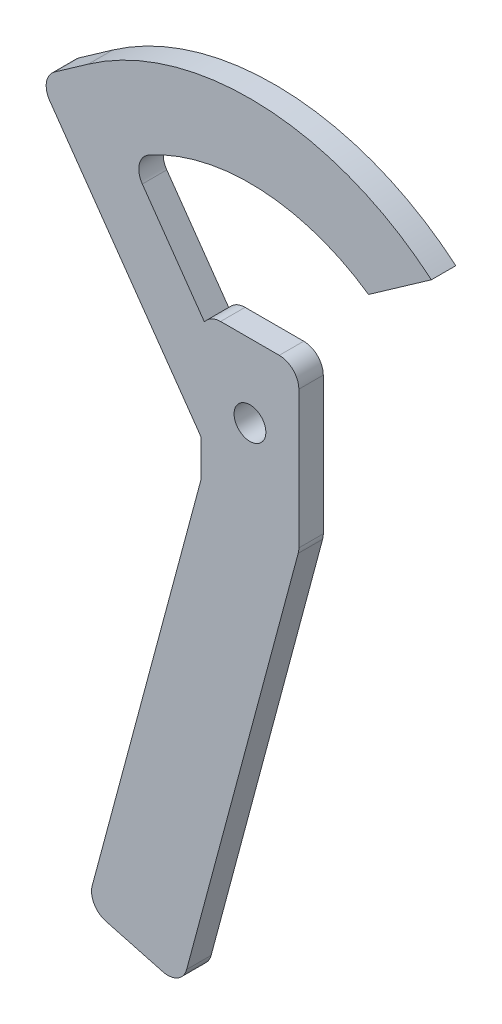
ISO-10303-21;
HEADER;
FILE_DESCRIPTION(('STEP AP214'),'2;1');
FILE_NAME('part.step','',(''),(''),'','','');
FILE_SCHEMA(('AUTOMOTIVE_DESIGN { 1 0 10303 214 1 1 1 1 }'));
ENDSEC;
DATA;
#1=APPLICATION_CONTEXT('core data for automotive mechanical design processes');
#2=APPLICATION_PROTOCOL_DEFINITION('international standard','automotive_design',2000,#1);
#3=PRODUCT_CONTEXT('',#1,'mechanical');
#4=PRODUCT('Part','Part','',(#3));
#5=PRODUCT_RELATED_PRODUCT_CATEGORY('part','',(#4));
#6=PRODUCT_DEFINITION_FORMATION('','',#4);
#7=PRODUCT_DEFINITION_CONTEXT('part definition',#1,'design');
#8=PRODUCT_DEFINITION('design','',#6,#7);
#9=PRODUCT_DEFINITION_SHAPE('','',#8);
#10=(LENGTH_UNIT() NAMED_UNIT(*) SI_UNIT(.MILLI.,.METRE.));
#11=(NAMED_UNIT(*) PLANE_ANGLE_UNIT() SI_UNIT($,.RADIAN.));
#12=(NAMED_UNIT(*) SI_UNIT($,.STERADIAN.) SOLID_ANGLE_UNIT());
#13=UNCERTAINTY_MEASURE_WITH_UNIT(LENGTH_MEASURE(1.E-05),#10,'distance_accuracy_value','');
#14=(GEOMETRIC_REPRESENTATION_CONTEXT(3) GLOBAL_UNCERTAINTY_ASSIGNED_CONTEXT((#13)) GLOBAL_UNIT_ASSIGNED_CONTEXT((#10,
#11,#12)) REPRESENTATION_CONTEXT('',''));
#15=CARTESIAN_POINT('',(0.,0.,0.));
#16=DIRECTION('',(0.,0.,1.));
#17=DIRECTION('',(1.,0.,0.));
#18=AXIS2_PLACEMENT_3D('',#15,#16,#17);
#19=CARTESIAN_POINT('',(0.,221.32548310435,5.));
#20=DIRECTION('',(0.,-1.,0.));
#21=DIRECTION('',(0.,0.,-1.));
#22=AXIS2_PLACEMENT_3D('',#19,#20,#21);
#23=PLANE('',#22);
#24=DIRECTION('',(-1.,0.,0.));
#25=VECTOR('',#24,1.);
#26=CARTESIAN_POINT('',(0.,221.32548310435,0.));
#27=LINE('',#26,#25);
#28=CARTESIAN_POINT('',(299.53045515725,221.32548310435,0.));
#29=VERTEX_POINT('',#28);
#30=CARTESIAN_POINT('',(287.53045515725,221.32548310435,0.));
#31=VERTEX_POINT('',#30);
#32=EDGE_CURVE('E219',#29,#31,#27,.T.);
#33=ORIENTED_EDGE('',*,*,#32,.T.);
#34=DIRECTION('',(0.,0.,-1.));
#35=VECTOR('',#34,1.);
#36=CARTESIAN_POINT('',(287.53045515725,221.32548310435,5.));
#37=LINE('',#36,#35);
#38=CARTESIAN_POINT('',(287.53045515725,221.32548310435,5.));
#39=VERTEX_POINT('',#38);
#40=EDGE_CURVE('E11',#39,#31,#37,.T.);
#41=ORIENTED_EDGE('',*,*,#40,.F.);
#42=DIRECTION('',(-1.,0.,0.));
#43=VECTOR('',#42,1.);
#44=CARTESIAN_POINT('',(0.,221.32548310435,5.));
#45=LINE('',#44,#43);
#46=CARTESIAN_POINT('',(299.53045515725,221.32548310435,5.));
#47=VERTEX_POINT('',#46);
#48=EDGE_CURVE('E377',#47,#39,#45,.T.);
#49=ORIENTED_EDGE('',*,*,#48,.F.);
#50=DIRECTION('',(0.,0.,-1.));
#51=VECTOR('',#50,1.);
#52=CARTESIAN_POINT('',(299.53045515725,221.32548310435,5.));
#53=LINE('',#52,#51);
#54=EDGE_CURVE('E212',#47,#29,#53,.T.);
#55=ORIENTED_EDGE('',*,*,#54,.T.);
#56=EDGE_LOOP('',(#33,#41,#49,#55));
#57=FACE_BOUND('',#56,.T.);
#58=ADVANCED_FACE('F35',(#57),#23,.F.);
#59=CARTESIAN_POINT('',(287.53045515725,217.32548310435,5.));
#60=DIRECTION('',(0.,0.,-1.));
#61=DIRECTION('',(-1.,0.,0.));
#62=AXIS2_PLACEMENT_3D('',#59,#60,#61);
#63=CYLINDRICAL_SURFACE('',#62,4.);
#64=CARTESIAN_POINT('',(287.53045515725,217.32548310435,0.));
#65=DIRECTION('',(0.,0.,1.));
#66=DIRECTION('',(1.,0.,0.));
#67=AXIS2_PLACEMENT_3D('',#64,#65,#66);
#68=CIRCLE('',#67,4.);
#69=CARTESIAN_POINT('',(284.223556624,219.5759101951,0.));
#70=VERTEX_POINT('',#69);
#71=EDGE_CURVE('E222',#31,#70,#68,.T.);
#72=ORIENTED_EDGE('',*,*,#71,.T.);
#73=DIRECTION('',(0.,0.,-1.));
#74=VECTOR('',#73,1.);
#75=CARTESIAN_POINT('',(284.223556624,219.5759101951,5.));
#76=LINE('',#75,#74);
#77=CARTESIAN_POINT('',(284.223556624,219.5759101951,5.));
#78=VERTEX_POINT('',#77);
#79=EDGE_CURVE('E44',#78,#70,#76,.T.);
#80=ORIENTED_EDGE('',*,*,#79,.F.);
#81=CARTESIAN_POINT('',(287.53045515725,217.32548310435,5.));
#82=DIRECTION('',(0.,0.,1.));
#83=DIRECTION('',(1.,0.,0.));
#84=AXIS2_PLACEMENT_3D('',#81,#82,#83);
#85=CIRCLE('',#84,4.);
#86=EDGE_CURVE('E137',#39,#78,#85,.T.);
#87=ORIENTED_EDGE('',*,*,#86,.F.);
#88=ORIENTED_EDGE('',*,*,#40,.T.);
#89=EDGE_LOOP('',(#72,#80,#87,#88));
#90=FACE_BOUND('',#89,.T.);
#91=ADVANCED_FACE('F391',(#90),#63,.T.);
#92=CARTESIAN_POINT('',(293.602960554349,206.222255646245,5.));
#93=DIRECTION('',(-0.818314055671164,-0.57477135131373,0.));
#94=DIRECTION('',(0.57477135131373,-0.818314055671164,0.));
#95=AXIS2_PLACEMENT_3D('',#92,#93,#94);
#96=PLANE('',#95);
#97=DIRECTION('',(-0.57477135131373,0.818314055671164,0.));
#98=VECTOR('',#97,1.);
#99=CARTESIAN_POINT('',(293.602960554349,206.222255646245,0.));
#100=LINE('',#99,#98);
#101=CARTESIAN_POINT('',(271.521515193,237.6600736019,0.));
#102=VERTEX_POINT('',#101);
#103=EDGE_CURVE('E224',#70,#102,#100,.T.);
#104=ORIENTED_EDGE('',*,*,#103,.T.);
#105=DIRECTION('',(0.,0.,-1.));
#106=VECTOR('',#105,1.);
#107=CARTESIAN_POINT('',(271.521515193,237.6600736019,5.));
#108=LINE('',#107,#106);
#109=CARTESIAN_POINT('',(271.521515193,237.6600736019,5.));
#110=VERTEX_POINT('',#109);
#111=EDGE_CURVE('E311',#110,#102,#108,.T.);
#112=ORIENTED_EDGE('',*,*,#111,.F.);
#113=DIRECTION('',(-0.57477135131373,0.818314055671164,0.));
#114=VECTOR('',#113,1.);
#115=CARTESIAN_POINT('',(293.602960554349,206.222255646245,5.));
#116=LINE('',#115,#114);
#117=EDGE_CURVE('E318',#78,#110,#116,.T.);
#118=ORIENTED_EDGE('',*,*,#117,.F.);
#119=ORIENTED_EDGE('',*,*,#79,.T.);
#120=EDGE_LOOP('',(#104,#112,#118,#119));
#121=FACE_BOUND('',#120,.T.);
#122=ADVANCED_FACE('F316',(#121),#96,.F.);
#123=CARTESIAN_POINT('',(274.794771415692,239.959159007145,5.));
#124=DIRECTION('',(0.,0.,-1.));
#125=DIRECTION('',(-1.,0.,0.));
#126=AXIS2_PLACEMENT_3D('',#123,#124,#125);
#127=CYLINDRICAL_SURFACE('',#126,4.00000000000004);
#128=CARTESIAN_POINT('',(274.794771415692,239.959159007145,0.));
#129=DIRECTION('',(0.,0.,1.));
#130=DIRECTION('',(1.,0.,0.));
#131=AXIS2_PLACEMENT_3D('',#128,#129,#130);
#132=CIRCLE('',#131,4.00000000000004);
#133=CARTESIAN_POINT('',(272.848206871121,243.453566893157,0.));
#134=VERTEX_POINT('',#133);
#135=EDGE_CURVE('E227',#134,#102,#132,.T.);
#136=ORIENTED_EDGE('',*,*,#135,.F.);
#137=DIRECTION('',(0.,0.,-1.));
#138=VECTOR('',#137,1.);
#139=CARTESIAN_POINT('',(272.848206871121,243.453566893157,5.));
#140=LINE('',#139,#138);
#141=CARTESIAN_POINT('',(272.848206871121,243.453566893157,5.));
#142=VERTEX_POINT('',#141);
#143=EDGE_CURVE('E309',#142,#134,#140,.T.);
#144=ORIENTED_EDGE('',*,*,#143,.F.);
#145=CARTESIAN_POINT('',(274.794771415692,239.959159007145,5.));
#146=DIRECTION('',(0.,0.,1.));
#147=DIRECTION('',(1.,0.,0.));
#148=AXIS2_PLACEMENT_3D('',#145,#146,#147);
#149=CIRCLE('',#148,4.00000000000004);
#150=EDGE_CURVE('E329',#142,#110,#149,.T.);
#151=ORIENTED_EDGE('',*,*,#150,.T.);
#152=ORIENTED_EDGE('',*,*,#111,.T.);
#153=EDGE_LOOP('',(#136,#144,#151,#152));
#154=FACE_BOUND('',#153,.T.);
#155=ADVANCED_FACE('F326',(#154),#127,.F.);
#156=CARTESIAN_POINT('',(293.530455157242,206.325483104316,5.));
#157=DIRECTION('',(0.,0.,-1.));
#158=DIRECTION('',(-1.,0.,0.));
#159=AXIS2_PLACEMENT_3D('',#156,#157,#158);
#160=CYLINDRICAL_SURFACE('',#159,42.5);
#161=CARTESIAN_POINT('',(293.530455157242,206.325483104316,0.));
#162=DIRECTION('',(0.,0.,1.));
#163=DIRECTION('',(1.,0.,0.));
#164=AXIS2_PLACEMENT_3D('',#161,#162,#163);
#165=CIRCLE('',#164,42.5);
#166=CARTESIAN_POINT('',(317.78434787185,241.2253210436,0.));
#167=VERTEX_POINT('',#166);
#168=EDGE_CURVE('E230',#167,#134,#165,.T.);
#169=ORIENTED_EDGE('',*,*,#168,.F.);
#170=DIRECTION('',(0.,0.,-1.));
#171=VECTOR('',#170,1.);
#172=CARTESIAN_POINT('',(317.78434787185,241.2253210436,5.));
#173=LINE('',#172,#171);
#174=CARTESIAN_POINT('',(317.78434787185,241.2253210436,5.));
#175=VERTEX_POINT('',#174);
#176=EDGE_CURVE('E307',#175,#167,#173,.T.);
#177=ORIENTED_EDGE('',*,*,#176,.F.);
#178=CARTESIAN_POINT('',(293.530455157242,206.325483104316,5.));
#179=DIRECTION('',(0.,0.,1.));
#180=DIRECTION('',(1.,0.,0.));
#181=AXIS2_PLACEMENT_3D('',#178,#179,#180);
#182=CIRCLE('',#181,42.5);
#183=EDGE_CURVE('E332',#175,#142,#182,.T.);
#184=ORIENTED_EDGE('',*,*,#183,.T.);
#185=ORIENTED_EDGE('',*,*,#143,.T.);
#186=EDGE_LOOP('',(#169,#177,#184,#185));
#187=FACE_BOUND('',#186,.T.);
#188=ADVANCED_FACE('F401',(#187),#160,.F.);
#189=CARTESIAN_POINT('',(-8.47484938695295,12.0658212298591,5.));
#190=DIRECTION('',(-0.574771351316157,0.818314055669459,0.));
#191=DIRECTION('',(-0.818314055669459,-0.574771351316157,0.));
#192=AXIS2_PLACEMENT_3D('',#189,#190,#191);
#193=PLANE('',#192);
#194=DIRECTION('',(0.818314055669459,0.574771351316157,0.));
#195=VECTOR('',#194,1.);
#196=CARTESIAN_POINT('',(-8.47484938695295,12.0658212298591,0.));
#197=LINE('',#196,#195);
#198=CARTESIAN_POINT('',(330.6351066323,250.2514986181,0.));
#199=VERTEX_POINT('',#198);
#200=EDGE_CURVE('E233',#167,#199,#197,.T.);
#201=ORIENTED_EDGE('',*,*,#200,.T.);
#202=DIRECTION('',(0.,0.,-1.));
#203=VECTOR('',#202,1.);
#204=CARTESIAN_POINT('',(330.6351066323,250.2514986181,5.));
#205=LINE('',#204,#203);
#206=CARTESIAN_POINT('',(330.6351066323,250.2514986181,5.));
#207=VERTEX_POINT('',#206);
#208=EDGE_CURVE('E304',#207,#199,#205,.T.);
#209=ORIENTED_EDGE('',*,*,#208,.F.);
#210=DIRECTION('',(0.818314055669459,0.574771351316157,0.));
#211=VECTOR('',#210,1.);
#212=CARTESIAN_POINT('',(-8.47484938695295,12.0658212298591,5.));
#213=LINE('',#212,#211);
#214=EDGE_CURVE('E334',#175,#207,#213,.T.);
#215=ORIENTED_EDGE('',*,*,#214,.F.);
#216=ORIENTED_EDGE('',*,*,#176,.T.);
#217=EDGE_LOOP('',(#201,#209,#215,#216));
#218=FACE_BOUND('',#217,.T.);
#219=ADVANCED_FACE('F404',(#218),#193,.F.);
#220=CARTESIAN_POINT('',(293.530455157242,206.325483104316,5.));
#221=DIRECTION('',(0.,0.,-1.));
#222=DIRECTION('',(-1.,0.,0.));
#223=AXIS2_PLACEMENT_3D('',#220,#221,#222);
#224=CYLINDRICAL_SURFACE('',#223,57.5000000000235);
#225=CARTESIAN_POINT('',(293.530455157242,206.325483104316,0.));
#226=DIRECTION('',(0.,0.,1.));
#227=DIRECTION('',(1.,0.,0.));
#228=AXIS2_PLACEMENT_3D('',#225,#226,#227);
#229=CIRCLE('',#228,57.5000000000235);
#230=CARTESIAN_POINT('',(260.481102456684,253.378541305423,0.));
#231=VERTEX_POINT('',#230);
#232=EDGE_CURVE('E235',#199,#231,#229,.T.);
#233=ORIENTED_EDGE('',*,*,#232,.T.);
#234=DIRECTION('',(0.,0.,-1.));
#235=VECTOR('',#234,1.);
#236=CARTESIAN_POINT('',(260.481102456684,253.378541305423,5.));
#237=LINE('',#236,#235);
#238=CARTESIAN_POINT('',(260.481102456684,253.378541305423,5.));
#239=VERTEX_POINT('',#238);
#240=EDGE_CURVE('E301',#239,#231,#237,.T.);
#241=ORIENTED_EDGE('',*,*,#240,.F.);
#242=CARTESIAN_POINT('',(293.530455157242,206.325483104316,5.));
#243=DIRECTION('',(0.,0.,1.));
#244=DIRECTION('',(1.,0.,0.));
#245=AXIS2_PLACEMENT_3D('',#242,#243,#244);
#246=CIRCLE('',#245,57.5000000000235);
#247=EDGE_CURVE('E340',#207,#239,#246,.T.);
#248=ORIENTED_EDGE('',*,*,#247,.F.);
#249=ORIENTED_EDGE('',*,*,#208,.T.);
#250=EDGE_LOOP('',(#233,#241,#248,#249));
#251=FACE_BOUND('',#250,.T.);
#252=ADVANCED_FACE('F408',(#251),#224,.T.);
#253=CARTESIAN_POINT('',(-33.1218580982247,47.1562856603346,5.));
#254=DIRECTION('',(0.574771351310836,-0.818314055673196,0.));
#255=DIRECTION('',(0.818314055673197,0.574771351310836,0.));
#256=AXIS2_PLACEMENT_3D('',#253,#254,#255);
#257=PLANE('',#256);
#258=DIRECTION('',(-0.818314055673197,-0.574771351310836,0.));
#259=VECTOR('',#258,1.);
#260=CARTESIAN_POINT('',(-33.1218580982247,47.1562856603346,0.));
#261=LINE('',#260,#259);
#262=CARTESIAN_POINT('',(253.558218086034,248.516012576873,0.));
#263=VERTEX_POINT('',#262);
#264=EDGE_CURVE('E237',#231,#263,#261,.T.);
#265=ORIENTED_EDGE('',*,*,#264,.T.);
#266=DIRECTION('',(0.,0.,-1.));
#267=VECTOR('',#266,1.);
#268=CARTESIAN_POINT('',(253.558218086034,248.516012576873,5.));
#269=LINE('',#268,#267);
#270=CARTESIAN_POINT('',(253.558218086034,248.516012576873,5.));
#271=VERTEX_POINT('',#270);
#272=EDGE_CURVE('E298',#271,#263,#269,.T.);
#273=ORIENTED_EDGE('',*,*,#272,.F.);
#274=DIRECTION('',(-0.818314055673197,-0.574771351310836,0.));
#275=VECTOR('',#274,1.);
#276=CARTESIAN_POINT('',(-33.1218580982247,47.1562856603346,5.));
#277=LINE('',#276,#275);
#278=EDGE_CURVE('E342',#239,#271,#277,.T.);
#279=ORIENTED_EDGE('',*,*,#278,.F.);
#280=ORIENTED_EDGE('',*,*,#240,.T.);
#281=EDGE_LOOP('',(#265,#273,#279,#280));
#282=FACE_BOUND('',#281,.T.);
#283=ADVANCED_FACE('F412',(#282),#257,.F.);
#284=CARTESIAN_POINT('',(255.857303491304,245.242756354199,5.));
#285=DIRECTION('',(0.,0.,-1.));
#286=DIRECTION('',(-1.,0.,0.));
#287=AXIS2_PLACEMENT_3D('',#284,#285,#286);
#288=CYLINDRICAL_SURFACE('',#287,4.00000000000005);
#289=CARTESIAN_POINT('',(255.857303491304,245.242756354199,0.));
#290=DIRECTION('',(0.,0.,1.));
#291=DIRECTION('',(1.,0.,0.));
#292=AXIS2_PLACEMENT_3D('',#289,#290,#291);
#293=CIRCLE('',#292,4.00000000000005);
#294=CARTESIAN_POINT('',(252.584047268634,242.943670948923,0.));
#295=VERTEX_POINT('',#294);
#296=EDGE_CURVE('E239',#263,#295,#293,.T.);
#297=ORIENTED_EDGE('',*,*,#296,.T.);
#298=DIRECTION('',(0.,0.,-1.));
#299=VECTOR('',#298,1.);
#300=CARTESIAN_POINT('',(252.584047268634,242.943670948923,5.));
#301=LINE('',#300,#299);
#302=CARTESIAN_POINT('',(252.584047268634,242.943670948923,5.));
#303=VERTEX_POINT('',#302);
#304=EDGE_CURVE('E295',#303,#295,#301,.T.);
#305=ORIENTED_EDGE('',*,*,#304,.F.);
#306=CARTESIAN_POINT('',(255.857303491304,245.242756354199,5.));
#307=DIRECTION('',(0.,0.,1.));
#308=DIRECTION('',(1.,0.,0.));
#309=AXIS2_PLACEMENT_3D('',#306,#307,#308);
#310=CIRCLE('',#309,4.00000000000005);
#311=EDGE_CURVE('E344',#271,#303,#310,.T.);
#312=ORIENTED_EDGE('',*,*,#311,.F.);
#313=ORIENTED_EDGE('',*,*,#272,.T.);
#314=EDGE_LOOP('',(#297,#305,#312,#313));
#315=FACE_BOUND('',#314,.T.);
#316=ADVANCED_FACE('F416',(#315),#288,.T.);
#317=CARTESIAN_POINT('',(283.406819960912,199.060641512692,5.));
#318=DIRECTION('',(0.818314055670675,0.574771351314425,0.));
#319=DIRECTION('',(-0.574771351314425,0.818314055670675,0.));
#320=AXIS2_PLACEMENT_3D('',#317,#318,#319);
#321=PLANE('',#320);
#322=DIRECTION('',(0.574771351314425,-0.818314055670675,0.));
#323=VECTOR('',#322,1.);
#324=CARTESIAN_POINT('',(283.406819960912,199.060641512692,0.));
#325=LINE('',#324,#323);
#326=CARTESIAN_POINT('',(282.759543212634,199.982183026223,0.));
#327=VERTEX_POINT('',#326);
#328=EDGE_CURVE('E241',#295,#327,#325,.T.);
#329=ORIENTED_EDGE('',*,*,#328,.T.);
#330=DIRECTION('',(0.,0.,-1.));
#331=VECTOR('',#330,1.);
#332=CARTESIAN_POINT('',(282.759543212634,199.982183026223,5.));
#333=LINE('',#332,#331);
#334=CARTESIAN_POINT('',(282.759543212634,199.982183026223,5.));
#335=VERTEX_POINT('',#334);
#336=EDGE_CURVE('E292',#335,#327,#333,.T.);
#337=ORIENTED_EDGE('',*,*,#336,.F.);
#338=DIRECTION('',(0.574771351314425,-0.818314055670675,0.));
#339=VECTOR('',#338,1.);
#340=CARTESIAN_POINT('',(283.406819960912,199.060641512692,5.));
#341=LINE('',#340,#339);
#342=EDGE_CURVE('E346',#303,#335,#341,.T.);
#343=ORIENTED_EDGE('',*,*,#342,.F.);
#344=ORIENTED_EDGE('',*,*,#304,.T.);
#345=EDGE_LOOP('',(#329,#337,#343,#344));
#346=FACE_BOUND('',#345,.T.);
#347=ADVANCED_FACE('F420',(#346),#321,.F.);
#348=CARTESIAN_POINT('',(288.354497849131,191.56012583852,5.));
#349=DIRECTION('',(0.83295072408624,0.553347170629984,0.));
#350=DIRECTION('',(-0.553347170629984,0.83295072408624,0.));
#351=AXIS2_PLACEMENT_3D('',#348,#349,#350);
#352=PLANE('',#351);
#353=DIRECTION('',(0.553347170629984,-0.83295072408624,0.));
#354=VECTOR('',#353,1.);
#355=CARTESIAN_POINT('',(288.354497849131,191.56012583852,0.));
#356=LINE('',#355,#354);
#357=CARTESIAN_POINT('',(283.508108228884,198.855371857023,0.));
#358=VERTEX_POINT('',#357);
#359=EDGE_CURVE('E243',#327,#358,#356,.T.);
#360=ORIENTED_EDGE('',*,*,#359,.T.);
#361=DIRECTION('',(0.,0.,-1.));
#362=VECTOR('',#361,1.);
#363=CARTESIAN_POINT('',(283.508108228884,198.855371857023,5.));
#364=LINE('',#363,#362);
#365=CARTESIAN_POINT('',(283.508108228884,198.855371857023,5.));
#366=VERTEX_POINT('',#365);
#367=EDGE_CURVE('E289',#366,#358,#364,.T.);
#368=ORIENTED_EDGE('',*,*,#367,.F.);
#369=DIRECTION('',(0.553347170629984,-0.83295072408624,0.));
#370=VECTOR('',#369,1.);
#371=CARTESIAN_POINT('',(288.354497849131,191.56012583852,5.));
#372=LINE('',#371,#370);
#373=EDGE_CURVE('E348',#335,#366,#372,.T.);
#374=ORIENTED_EDGE('',*,*,#373,.F.);
#375=ORIENTED_EDGE('',*,*,#336,.T.);
#376=EDGE_LOOP('',(#360,#368,#374,#375));
#377=FACE_BOUND('',#376,.T.);
#378=ADVANCED_FACE('F424',(#377),#352,.F.);
#379=CARTESIAN_POINT('',(277.218331894607,207.267873393469,5.));
#380=DIRECTION('',(0.800894769479648,0.598805117062422,0.));
#381=DIRECTION('',(-0.598805117062422,0.800894769479648,0.));
#382=AXIS2_PLACEMENT_3D('',#379,#380,#381);
#383=PLANE('',#382);
#384=DIRECTION('',(0.598805117062422,-0.800894769479648,0.));
#385=VECTOR('',#384,1.);
#386=CARTESIAN_POINT('',(277.218331894607,207.267873393469,0.));
#387=LINE('',#386,#385);
#388=CARTESIAN_POINT('',(283.530455157242,198.825483104373,0.));
#389=VERTEX_POINT('',#388);
#390=EDGE_CURVE('E245',#358,#389,#387,.T.);
#391=ORIENTED_EDGE('',*,*,#390,.T.);
#392=DIRECTION('',(0.,0.,-1.));
#393=VECTOR('',#392,1.);
#394=CARTESIAN_POINT('',(283.530455157242,198.825483104373,5.));
#395=LINE('',#394,#393);
#396=CARTESIAN_POINT('',(283.530455157242,198.825483104373,5.));
#397=VERTEX_POINT('',#396);
#398=EDGE_CURVE('E286',#397,#389,#395,.T.);
#399=ORIENTED_EDGE('',*,*,#398,.F.);
#400=DIRECTION('',(0.598805117062422,-0.800894769479648,0.));
#401=VECTOR('',#400,1.);
#402=CARTESIAN_POINT('',(277.218331894607,207.267873393469,5.));
#403=LINE('',#402,#401);
#404=EDGE_CURVE('E350',#366,#397,#403,.T.);
#405=ORIENTED_EDGE('',*,*,#404,.F.);
#406=ORIENTED_EDGE('',*,*,#367,.T.);
#407=EDGE_LOOP('',(#391,#399,#405,#406));
#408=FACE_BOUND('',#407,.T.);
#409=ADVANCED_FACE('F428',(#408),#383,.F.);
#410=CARTESIAN_POINT('',(283.53045515725,0.,5.));
#411=DIRECTION('',(1.,0.,0.));
#412=DIRECTION('',(0.,0.,-1.));
#413=AXIS2_PLACEMENT_3D('',#410,#411,#412);
#414=PLANE('',#413);
#415=DIRECTION('',(0.,-1.,0.));
#416=VECTOR('',#415,1.);
#417=CARTESIAN_POINT('',(283.53045515725,0.,0.));
#418=LINE('',#417,#416);
#419=CARTESIAN_POINT('',(283.53045515725,191.8520930947,0.));
#420=VERTEX_POINT('',#419);
#421=EDGE_CURVE('E247',#389,#420,#418,.T.);
#422=ORIENTED_EDGE('',*,*,#421,.T.);
#423=DIRECTION('',(0.,0.,-1.));
#424=VECTOR('',#423,1.);
#425=CARTESIAN_POINT('',(283.53045515725,191.8520930947,5.));
#426=LINE('',#425,#424);
#427=CARTESIAN_POINT('',(283.53045515725,191.8520930947,5.));
#428=VERTEX_POINT('',#427);
#429=EDGE_CURVE('E284',#428,#420,#426,.T.);
#430=ORIENTED_EDGE('',*,*,#429,.F.);
#431=DIRECTION('',(0.,-1.,0.));
#432=VECTOR('',#431,1.);
#433=CARTESIAN_POINT('',(283.53045515725,0.,5.));
#434=LINE('',#433,#432);
#435=EDGE_CURVE('E352',#397,#428,#434,.T.);
#436=ORIENTED_EDGE('',*,*,#435,.F.);
#437=ORIENTED_EDGE('',*,*,#398,.T.);
#438=EDGE_LOOP('',(#422,#430,#436,#437));
#439=FACE_BOUND('',#438,.T.);
#440=ADVANCED_FACE('F432',(#439),#414,.F.);
#441=CARTESIAN_POINT('',(279.53045515725,191.852093094733,5.));
#442=DIRECTION('',(0.,0.,-1.));
#443=DIRECTION('',(-1.,0.,0.));
#444=AXIS2_PLACEMENT_3D('',#441,#442,#443);
#445=CYLINDRICAL_SURFACE('',#444,4.00000000000006);
#446=CARTESIAN_POINT('',(279.53045515725,191.852093094733,0.));
#447=DIRECTION('',(0.,0.,1.));
#448=DIRECTION('',(1.,0.,0.));
#449=AXIS2_PLACEMENT_3D('',#446,#447,#448);
#450=CIRCLE('',#449,4.00000000000006);
#451=CARTESIAN_POINT('',(283.3941584624,190.8168169143,0.));
#452=VERTEX_POINT('',#451);
#453=EDGE_CURVE('E250',#452,#420,#450,.T.);
#454=ORIENTED_EDGE('',*,*,#453,.F.);
#455=DIRECTION('',(0.,0.,-1.));
#456=VECTOR('',#455,1.);
#457=CARTESIAN_POINT('',(283.3941584624,190.8168169143,5.));
#458=LINE('',#457,#456);
#459=CARTESIAN_POINT('',(283.3941584624,190.8168169143,5.));
#460=VERTEX_POINT('',#459);
#461=EDGE_CURVE('E282',#460,#452,#458,.T.);
#462=ORIENTED_EDGE('',*,*,#461,.F.);
#463=CARTESIAN_POINT('',(279.53045515725,191.852093094733,5.));
#464=DIRECTION('',(0.,0.,1.));
#465=DIRECTION('',(1.,0.,0.));
#466=AXIS2_PLACEMENT_3D('',#463,#464,#465);
#467=CIRCLE('',#466,4.00000000000006);
#468=EDGE_CURVE('E354',#460,#428,#467,.T.);
#469=ORIENTED_EDGE('',*,*,#468,.T.);
#470=ORIENTED_EDGE('',*,*,#429,.T.);
#471=EDGE_LOOP('',(#454,#462,#469,#470));
#472=FACE_BOUND('',#471,.T.);
#473=ADVANCED_FACE('F436',(#472),#445,.F.);
#474=CARTESIAN_POINT('',(216.706145258981,-58.0662366169446,5.));
#475=DIRECTION('',(0.965925826289136,-0.258819045102267,0.));
#476=DIRECTION('',(0.258819045102267,0.965925826289136,0.));
#477=AXIS2_PLACEMENT_3D('',#474,#475,#476);
#478=PLANE('',#477);
#479=DIRECTION('',(-0.258819045102267,-0.965925826289136,0.));
#480=VECTOR('',#479,1.);
#481=CARTESIAN_POINT('',(216.706145258981,-58.0662366169446,0.));
#482=LINE('',#481,#480);
#483=CARTESIAN_POINT('',(261.27201727845,108.2558620435,0.));
#484=VERTEX_POINT('',#483);
#485=EDGE_CURVE('E253',#452,#484,#482,.T.);
#486=ORIENTED_EDGE('',*,*,#485,.T.);
#487=DIRECTION('',(0.,0.,-1.));
#488=VECTOR('',#487,1.);
#489=CARTESIAN_POINT('',(261.27201727845,108.2558620435,5.));
#490=LINE('',#489,#488);
#491=CARTESIAN_POINT('',(261.27201727845,108.2558620435,5.));
#492=VERTEX_POINT('',#491);
#493=EDGE_CURVE('E279',#492,#484,#490,.T.);
#494=ORIENTED_EDGE('',*,*,#493,.F.);
#495=DIRECTION('',(-0.258819045102267,-0.965925826289136,0.));
#496=VECTOR('',#495,1.);
#497=CARTESIAN_POINT('',(216.706145258981,-58.0662366169446,5.));
#498=LINE('',#497,#496);
#499=EDGE_CURVE('E357',#460,#492,#498,.T.);
#500=ORIENTED_EDGE('',*,*,#499,.F.);
#501=ORIENTED_EDGE('',*,*,#461,.T.);
#502=EDGE_LOOP('',(#486,#494,#500,#501));
#503=FACE_BOUND('',#502,.T.);
#504=ADVANCED_FACE('F440',(#503),#478,.F.);
#505=CARTESIAN_POINT('',(265.135720583598,107.220585863059,5.));
#506=DIRECTION('',(0.,0.,-1.));
#507=DIRECTION('',(-1.,0.,0.));
#508=AXIS2_PLACEMENT_3D('',#505,#506,#507);
#509=CYLINDRICAL_SURFACE('',#508,4.00000000000001);
#510=CARTESIAN_POINT('',(265.135720583598,107.220585863059,0.));
#511=DIRECTION('',(0.,0.,1.));
#512=DIRECTION('',(1.,0.,0.));
#513=AXIS2_PLACEMENT_3D('',#510,#511,#512);
#514=CIRCLE('',#513,4.00000000000001);
#515=CARTESIAN_POINT('',(264.1004444032,103.3568825579,0.));
#516=VERTEX_POINT('',#515);
#517=EDGE_CURVE('E255',#484,#516,#514,.T.);
#518=ORIENTED_EDGE('',*,*,#517,.T.);
#519=DIRECTION('',(0.,0.,-1.));
#520=VECTOR('',#519,1.);
#521=CARTESIAN_POINT('',(264.1004444032,103.3568825579,5.));
#522=LINE('',#521,#520);
#523=CARTESIAN_POINT('',(264.1004444032,103.3568825579,5.));
#524=VERTEX_POINT('',#523);
#525=EDGE_CURVE('E276',#524,#516,#522,.T.);
#526=ORIENTED_EDGE('',*,*,#525,.F.);
#527=CARTESIAN_POINT('',(265.135720583598,107.220585863059,5.));
#528=DIRECTION('',(0.,0.,1.));
#529=DIRECTION('',(1.,0.,0.));
#530=AXIS2_PLACEMENT_3D('',#527,#528,#529);
#531=CIRCLE('',#530,4.00000000000001);
#532=EDGE_CURVE('E359',#492,#524,#531,.T.);
#533=ORIENTED_EDGE('',*,*,#532,.F.);
#534=ORIENTED_EDGE('',*,*,#493,.T.);
#535=EDGE_LOOP('',(#518,#526,#533,#534));
#536=FACE_BOUND('',#535,.T.);
#537=ADVANCED_FACE('F444',(#536),#509,.T.);
#538=CARTESIAN_POINT('',(43.5305958386602,162.458395354944,5.));
#539=DIRECTION('',(0.258819045100562,0.965925826289593,0.));
#540=DIRECTION('',(-0.965925826289593,0.258819045100562,0.));
#541=AXIS2_PLACEMENT_3D('',#538,#539,#540);
#542=PLANE('',#541);
#543=DIRECTION('',(0.965925826289593,-0.258819045100562,0.));
#544=VECTOR('',#543,1.);
#545=CARTESIAN_POINT('',(43.5305958386602,162.458395354944,0.));
#546=LINE('',#545,#544);
#547=CARTESIAN_POINT('',(275.69155431865,100.2510540167,0.));
#548=VERTEX_POINT('',#547);
#549=EDGE_CURVE('E257',#516,#548,#546,.T.);
#550=ORIENTED_EDGE('',*,*,#549,.T.);
#551=DIRECTION('',(0.,0.,-1.));
#552=VECTOR('',#551,1.);
#553=CARTESIAN_POINT('',(275.69155431865,100.2510540167,5.));
#554=LINE('',#553,#552);
#555=CARTESIAN_POINT('',(275.69155431865,100.2510540167,5.));
#556=VERTEX_POINT('',#555);
#557=EDGE_CURVE('E273',#556,#548,#554,.T.);
#558=ORIENTED_EDGE('',*,*,#557,.F.);
#559=DIRECTION('',(0.965925826289593,-0.258819045100562,0.));
#560=VECTOR('',#559,1.);
#561=CARTESIAN_POINT('',(43.5305958386602,162.458395354944,5.));
#562=LINE('',#561,#560);
#563=EDGE_CURVE('E361',#524,#556,#562,.T.);
#564=ORIENTED_EDGE('',*,*,#563,.F.);
#565=ORIENTED_EDGE('',*,*,#525,.T.);
#566=EDGE_LOOP('',(#550,#558,#564,#565));
#567=FACE_BOUND('',#566,.T.);
#568=ADVANCED_FACE('F448',(#567),#542,.F.);
#569=CARTESIAN_POINT('',(276.726830499044,104.114757321861,5.));
#570=DIRECTION('',(0.,0.,-1.));
#571=DIRECTION('',(-1.,0.,0.));
#572=AXIS2_PLACEMENT_3D('',#569,#570,#571);
#573=CYLINDRICAL_SURFACE('',#572,4.00000000000003);
#574=CARTESIAN_POINT('',(276.726830499044,104.114757321861,0.));
#575=DIRECTION('',(0.,0.,1.));
#576=DIRECTION('',(1.,0.,0.));
#577=AXIS2_PLACEMENT_3D('',#574,#575,#576);
#578=CIRCLE('',#577,4.00000000000003);
#579=CARTESIAN_POINT('',(280.5905338042,103.07948114145,0.));
#580=VERTEX_POINT('',#579);
#581=EDGE_CURVE('E259',#548,#580,#578,.T.);
#582=ORIENTED_EDGE('',*,*,#581,.T.);
#583=DIRECTION('',(0.,0.,-1.));
#584=VECTOR('',#583,1.);
#585=CARTESIAN_POINT('',(280.5905338042,103.07948114145,5.));
#586=LINE('',#585,#584);
#587=CARTESIAN_POINT('',(280.5905338042,103.07948114145,5.));
#588=VERTEX_POINT('',#587);
#589=EDGE_CURVE('E270',#588,#580,#586,.T.);
#590=ORIENTED_EDGE('',*,*,#589,.F.);
#591=CARTESIAN_POINT('',(276.726830499044,104.114757321861,5.));
#592=DIRECTION('',(0.,0.,1.));
#593=DIRECTION('',(1.,0.,0.));
#594=AXIS2_PLACEMENT_3D('',#591,#592,#593);
#595=CIRCLE('',#594,4.00000000000003);
#596=EDGE_CURVE('E363',#556,#588,#595,.T.);
#597=ORIENTED_EDGE('',*,*,#596,.F.);
#598=ORIENTED_EDGE('',*,*,#557,.T.);
#599=EDGE_LOOP('',(#582,#590,#597,#598));
#600=FACE_BOUND('',#599,.T.);
#601=ADVANCED_FACE('F369',(#600),#573,.T.);
#602=CARTESIAN_POINT('',(236.024661784652,-63.2426175190509,5.));
#603=DIRECTION('',(-0.965925826289043,0.258819045102614,0.));
#604=DIRECTION('',(-0.258819045102614,-0.965925826289043,0.));
#605=AXIS2_PLACEMENT_3D('',#602,#603,#604);
#606=PLANE('',#605);
#607=DIRECTION('',(0.258819045102614,0.965925826289043,0.));
#608=VECTOR('',#607,1.);
#609=CARTESIAN_POINT('',(236.024661784652,-63.2426175190509,0.));
#610=LINE('',#609,#608);
#611=CARTESIAN_POINT('',(303.3941584624,188.18376696255,0.));
#612=VERTEX_POINT('',#611);
#613=EDGE_CURVE('E261',#580,#612,#610,.T.);
#614=ORIENTED_EDGE('',*,*,#613,.T.);
#615=DIRECTION('',(0.,0.,-1.));
#616=VECTOR('',#615,1.);
#617=CARTESIAN_POINT('',(303.3941584624,188.18376696255,5.));
#618=LINE('',#617,#616);
#619=CARTESIAN_POINT('',(303.3941584624,188.18376696255,5.));
#620=VERTEX_POINT('',#619);
#621=EDGE_CURVE('E207',#620,#612,#618,.T.);
#622=ORIENTED_EDGE('',*,*,#621,.F.);
#623=DIRECTION('',(0.258819045102614,0.965925826289043,0.));
#624=VECTOR('',#623,1.);
#625=CARTESIAN_POINT('',(236.024661784652,-63.2426175190509,5.));
#626=LINE('',#625,#624);
#627=EDGE_CURVE('E198',#588,#620,#626,.T.);
#628=ORIENTED_EDGE('',*,*,#627,.F.);
#629=ORIENTED_EDGE('',*,*,#589,.T.);
#630=EDGE_LOOP('',(#614,#622,#628,#629));
#631=FACE_BOUND('',#630,.T.);
#632=ADVANCED_FACE('F373',(#631),#606,.F.);
#633=CARTESIAN_POINT('',(299.53045515725,189.219043142983,5.));
#634=DIRECTION('',(0.,0.,-1.));
#635=DIRECTION('',(-1.,0.,0.));
#636=AXIS2_PLACEMENT_3D('',#633,#634,#635);
#637=CYLINDRICAL_SURFACE('',#636,4.);
#638=CARTESIAN_POINT('',(299.53045515725,189.219043142983,0.));
#639=DIRECTION('',(0.,0.,1.));
#640=DIRECTION('',(1.,0.,0.));
#641=AXIS2_PLACEMENT_3D('',#638,#639,#640);
#642=CIRCLE('',#641,4.);
#643=CARTESIAN_POINT('',(303.53045515725,189.21904314295,0.));
#644=VERTEX_POINT('',#643);
#645=EDGE_CURVE('E206',#612,#644,#642,.T.);
#646=ORIENTED_EDGE('',*,*,#645,.T.);
#647=DIRECTION('',(0.,0.,-1.));
#648=VECTOR('',#647,1.);
#649=CARTESIAN_POINT('',(303.53045515725,189.21904314295,5.));
#650=LINE('',#649,#648);
#651=CARTESIAN_POINT('',(303.53045515725,189.21904314295,5.));
#652=VERTEX_POINT('',#651);
#653=EDGE_CURVE('E203',#652,#644,#650,.T.);
#654=ORIENTED_EDGE('',*,*,#653,.F.);
#655=CARTESIAN_POINT('',(299.53045515725,189.219043142983,5.));
#656=DIRECTION('',(0.,0.,1.));
#657=DIRECTION('',(1.,0.,0.));
#658=AXIS2_PLACEMENT_3D('',#655,#656,#657);
#659=CIRCLE('',#658,4.);
#660=EDGE_CURVE('E192',#620,#652,#659,.T.);
#661=ORIENTED_EDGE('',*,*,#660,.F.);
#662=ORIENTED_EDGE('',*,*,#621,.T.);
#663=EDGE_LOOP('',(#646,#654,#661,#662));
#664=FACE_BOUND('',#663,.T.);
#665=ADVANCED_FACE('F204',(#664),#637,.T.);
#666=CARTESIAN_POINT('',(303.53045515725,0.,5.));
#667=DIRECTION('',(-1.,0.,0.));
#668=DIRECTION('',(0.,0.,1.));
#669=AXIS2_PLACEMENT_3D('',#666,#667,#668);
#670=PLANE('',#669);
#671=DIRECTION('',(0.,1.,0.));
#672=VECTOR('',#671,1.);
#673=CARTESIAN_POINT('',(303.53045515725,0.,0.));
#674=LINE('',#673,#672);
#675=CARTESIAN_POINT('',(303.53045515725,217.32548310435,0.));
#676=VERTEX_POINT('',#675);
#677=EDGE_CURVE('E123',#644,#676,#674,.T.);
#678=ORIENTED_EDGE('',*,*,#677,.T.);
#679=DIRECTION('',(0.,0.,-1.));
#680=VECTOR('',#679,1.);
#681=CARTESIAN_POINT('',(303.53045515725,217.32548310435,5.));
#682=LINE('',#681,#680);
#683=CARTESIAN_POINT('',(303.53045515725,217.32548310435,5.));
#684=VERTEX_POINT('',#683);
#685=EDGE_CURVE('E208',#684,#676,#682,.T.);
#686=ORIENTED_EDGE('',*,*,#685,.F.);
#687=DIRECTION('',(0.,1.,0.));
#688=VECTOR('',#687,1.);
#689=CARTESIAN_POINT('',(303.53045515725,0.,5.));
#690=LINE('',#689,#688);
#691=EDGE_CURVE('E196',#652,#684,#690,.T.);
#692=ORIENTED_EDGE('',*,*,#691,.F.);
#693=ORIENTED_EDGE('',*,*,#653,.T.);
#694=EDGE_LOOP('',(#678,#686,#692,#693));
#695=FACE_BOUND('',#694,.T.);
#696=ADVANCED_FACE('F210',(#695),#670,.F.);
#697=CARTESIAN_POINT('',(293.530455157242,206.325483104316,5.));
#698=DIRECTION('',(0.,0.,-1.));
#699=DIRECTION('',(-1.,0.,0.));
#700=AXIS2_PLACEMENT_3D('',#697,#698,#699);
#701=CYLINDRICAL_SURFACE('',#700,3.25000000000747);
#702=CARTESIAN_POINT('',(293.530455157242,206.325483104316,5.));
#703=DIRECTION('',(0.,0.,1.));
#704=DIRECTION('',(1.,0.,0.));
#705=AXIS2_PLACEMENT_3D('',#702,#703,#704);
#706=CIRCLE('',#705,3.25000000000747);
#707=CARTESIAN_POINT('',(296.78045515725,206.325483104316,5.));
#708=VERTEX_POINT('',#707);
#709=EDGE_CURVE('E266',#708,#708,#706,.T.);
#710=ORIENTED_EDGE('',*,*,#709,.T.);
#711=EDGE_LOOP('',(#710));
#712=FACE_BOUND('',#711,.T.);
#713=CARTESIAN_POINT('',(293.530455157242,206.325483104316,0.));
#714=DIRECTION('',(0.,0.,1.));
#715=DIRECTION('',(1.,0.,0.));
#716=AXIS2_PLACEMENT_3D('',#713,#714,#715);
#717=CIRCLE('',#716,3.25000000000747);
#718=CARTESIAN_POINT('',(296.78045515725,206.325483104316,0.));
#719=VERTEX_POINT('',#718);
#720=EDGE_CURVE('E216',#719,#719,#717,.T.);
#721=ORIENTED_EDGE('',*,*,#720,.F.);
#722=EDGE_LOOP('',(#721));
#723=FACE_BOUND('',#722,.T.);
#724=ADVANCED_FACE('F37',(#712,#723),#701,.F.);
#725=CARTESIAN_POINT('',(299.53045515725,217.32548310435,5.));
#726=DIRECTION('',(0.,0.,-1.));
#727=DIRECTION('',(-1.,0.,0.));
#728=AXIS2_PLACEMENT_3D('',#725,#726,#727);
#729=CYLINDRICAL_SURFACE('',#728,4.);
#730=CARTESIAN_POINT('',(299.53045515725,217.32548310435,0.));
#731=DIRECTION('',(0.,0.,1.));
#732=DIRECTION('',(1.,0.,0.));
#733=AXIS2_PLACEMENT_3D('',#730,#731,#732);
#734=CIRCLE('',#733,4.);
#735=EDGE_CURVE('E129',#676,#29,#734,.T.);
#736=ORIENTED_EDGE('',*,*,#735,.T.);
#737=ORIENTED_EDGE('',*,*,#54,.F.);
#738=CARTESIAN_POINT('',(299.53045515725,217.32548310435,5.));
#739=DIRECTION('',(0.,0.,1.));
#740=DIRECTION('',(1.,0.,0.));
#741=AXIS2_PLACEMENT_3D('',#738,#739,#740);
#742=CIRCLE('',#741,4.);
#743=EDGE_CURVE('E52',#684,#47,#742,.T.);
#744=ORIENTED_EDGE('',*,*,#743,.F.);
#745=ORIENTED_EDGE('',*,*,#685,.T.);
#746=EDGE_LOOP('',(#736,#737,#744,#745));
#747=FACE_BOUND('',#746,.T.);
#748=ADVANCED_FACE('F378',(#747),#729,.T.);
#749=CARTESIAN_POINT('',(0.,0.,5.));
#750=DIRECTION('',(0.,0.,1.));
#751=DIRECTION('',(1.,0.,0.));
#752=AXIS2_PLACEMENT_3D('',#749,#750,#751);
#753=PLANE('',#752);
#754=ORIENTED_EDGE('',*,*,#709,.F.);
#755=EDGE_LOOP('',(#754));
#756=FACE_BOUND('',#755,.T.);
#757=ORIENTED_EDGE('',*,*,#48,.T.);
#758=ORIENTED_EDGE('',*,*,#86,.T.);
#759=ORIENTED_EDGE('',*,*,#117,.T.);
#760=ORIENTED_EDGE('',*,*,#150,.F.);
#761=ORIENTED_EDGE('',*,*,#183,.F.);
#762=ORIENTED_EDGE('',*,*,#214,.T.);
#763=ORIENTED_EDGE('',*,*,#247,.T.);
#764=ORIENTED_EDGE('',*,*,#278,.T.);
#765=ORIENTED_EDGE('',*,*,#311,.T.);
#766=ORIENTED_EDGE('',*,*,#342,.T.);
#767=ORIENTED_EDGE('',*,*,#373,.T.);
#768=ORIENTED_EDGE('',*,*,#404,.T.);
#769=ORIENTED_EDGE('',*,*,#435,.T.);
#770=ORIENTED_EDGE('',*,*,#468,.F.);
#771=ORIENTED_EDGE('',*,*,#499,.T.);
#772=ORIENTED_EDGE('',*,*,#532,.T.);
#773=ORIENTED_EDGE('',*,*,#563,.T.);
#774=ORIENTED_EDGE('',*,*,#596,.T.);
#775=ORIENTED_EDGE('',*,*,#627,.T.);
#776=ORIENTED_EDGE('',*,*,#660,.T.);
#777=ORIENTED_EDGE('',*,*,#691,.T.);
#778=ORIENTED_EDGE('',*,*,#743,.T.);
#779=EDGE_LOOP('',(#757,#758,#759,#760,#761,#762,#763,#764,#765,#766,#767,#768,#769,#770,#771,
#772,#773,#774,#775,#776,#777,#778));
#780=FACE_BOUND('',#779,.T.);
#781=ADVANCED_FACE('F194',(#756,#780),#753,.T.);
#782=CARTESIAN_POINT('',(0.,0.,0.));
#783=DIRECTION('',(0.,0.,1.));
#784=DIRECTION('',(1.,0.,0.));
#785=AXIS2_PLACEMENT_3D('',#782,#783,#784);
#786=PLANE('',#785);
#787=ORIENTED_EDGE('',*,*,#720,.T.);
#788=EDGE_LOOP('',(#787));
#789=FACE_BOUND('',#788,.T.);
#790=ORIENTED_EDGE('',*,*,#32,.F.);
#791=ORIENTED_EDGE('',*,*,#735,.F.);
#792=ORIENTED_EDGE('',*,*,#677,.F.);
#793=ORIENTED_EDGE('',*,*,#645,.F.);
#794=ORIENTED_EDGE('',*,*,#613,.F.);
#795=ORIENTED_EDGE('',*,*,#581,.F.);
#796=ORIENTED_EDGE('',*,*,#549,.F.);
#797=ORIENTED_EDGE('',*,*,#517,.F.);
#798=ORIENTED_EDGE('',*,*,#485,.F.);
#799=ORIENTED_EDGE('',*,*,#453,.T.);
#800=ORIENTED_EDGE('',*,*,#421,.F.);
#801=ORIENTED_EDGE('',*,*,#390,.F.);
#802=ORIENTED_EDGE('',*,*,#359,.F.);
#803=ORIENTED_EDGE('',*,*,#328,.F.);
#804=ORIENTED_EDGE('',*,*,#296,.F.);
#805=ORIENTED_EDGE('',*,*,#264,.F.);
#806=ORIENTED_EDGE('',*,*,#232,.F.);
#807=ORIENTED_EDGE('',*,*,#200,.F.);
#808=ORIENTED_EDGE('',*,*,#168,.T.);
#809=ORIENTED_EDGE('',*,*,#135,.T.);
#810=ORIENTED_EDGE('',*,*,#103,.F.);
#811=ORIENTED_EDGE('',*,*,#71,.F.);
#812=EDGE_LOOP('',(#790,#791,#792,#793,#794,#795,#796,#797,#798,#799,#800,#801,#802,#803,#804,
#805,#806,#807,#808,#809,#810,#811));
#813=FACE_BOUND('',#812,.T.);
#814=ADVANCED_FACE('F321',(#789,#813),#786,.F.);
#815=CLOSED_SHELL('',(#58,#91,#122,#155,#188,#219,#252,#283,#316,#347,#378,#409,#440,#473,#504,
#537,#568,#601,#632,#665,#696,#724,#748,#781,#814));
#816=MANIFOLD_SOLID_BREP('B2',#815);
#817=ADVANCED_BREP_SHAPE_REPRESENTATION('',(#18,#816),#14);
#818=SHAPE_DEFINITION_REPRESENTATION(#9,#817);
ENDSEC;
END-ISO-10303-21;
